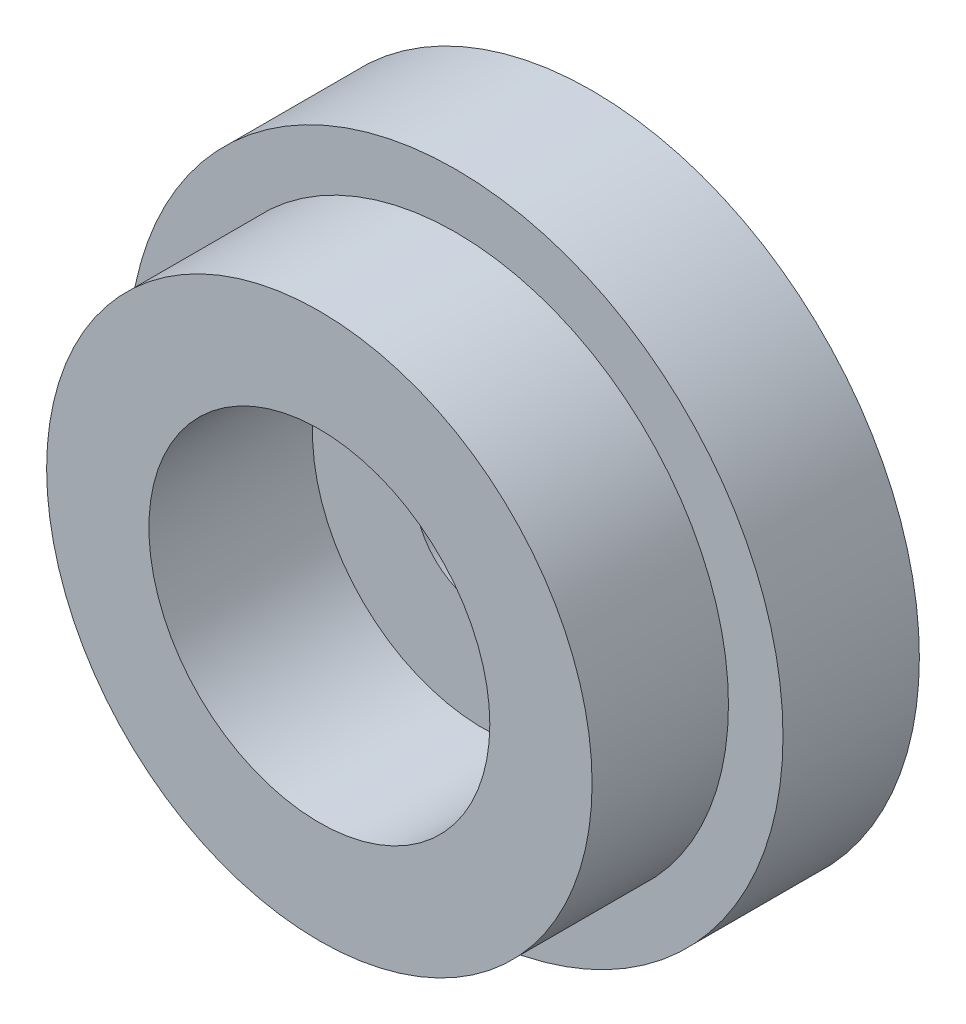
ISO-10303-21;
HEADER;
FILE_DESCRIPTION(('STEP AP214'),'2;1');
FILE_NAME('part.step','',(''),(''),'','','');
FILE_SCHEMA(('AUTOMOTIVE_DESIGN { 1 0 10303 214 1 1 1 1 }'));
ENDSEC;
DATA;
#1=APPLICATION_CONTEXT('core data for automotive mechanical design processes');
#2=APPLICATION_PROTOCOL_DEFINITION('international standard','automotive_design',2000,#1);
#3=PRODUCT_CONTEXT('',#1,'mechanical');
#4=PRODUCT('Part','Part','',(#3));
#5=PRODUCT_RELATED_PRODUCT_CATEGORY('part','',(#4));
#6=PRODUCT_DEFINITION_FORMATION('','',#4);
#7=PRODUCT_DEFINITION_CONTEXT('part definition',#1,'design');
#8=PRODUCT_DEFINITION('design','',#6,#7);
#9=PRODUCT_DEFINITION_SHAPE('','',#8);
#10=(LENGTH_UNIT() NAMED_UNIT(*) SI_UNIT(.MILLI.,.METRE.));
#11=(NAMED_UNIT(*) PLANE_ANGLE_UNIT() SI_UNIT($,.RADIAN.));
#12=(NAMED_UNIT(*) SI_UNIT($,.STERADIAN.) SOLID_ANGLE_UNIT());
#13=UNCERTAINTY_MEASURE_WITH_UNIT(LENGTH_MEASURE(1.E-05),#10,'distance_accuracy_value','');
#14=(GEOMETRIC_REPRESENTATION_CONTEXT(3) GLOBAL_UNCERTAINTY_ASSIGNED_CONTEXT((#13)) GLOBAL_UNIT_ASSIGNED_CONTEXT((#10,
#11,#12)) REPRESENTATION_CONTEXT('',''));
#15=CARTESIAN_POINT('',(0.,0.,0.));
#16=DIRECTION('',(0.,0.,1.));
#17=DIRECTION('',(1.,0.,0.));
#18=AXIS2_PLACEMENT_3D('',#15,#16,#17);
#19=CARTESIAN_POINT('',(0.,0.,-10.));
#20=DIRECTION('',(0.,0.,1.));
#21=DIRECTION('',(1.,0.,0.));
#22=AXIS2_PLACEMENT_3D('',#19,#20,#21);
#23=CYLINDRICAL_SURFACE('',#22,5.);
#24=CARTESIAN_POINT('',(0.,0.,-8.00000000000001));
#25=DIRECTION('',(0.,0.,1.));
#26=DIRECTION('',(1.,0.,0.));
#27=AXIS2_PLACEMENT_3D('',#24,#25,#26);
#28=CIRCLE('',#27,5.);
#29=CARTESIAN_POINT('',(5.,0.,-8.00000000000001));
#30=VERTEX_POINT('',#29);
#31=EDGE_CURVE('E112',#30,#30,#28,.T.);
#32=ORIENTED_EDGE('',*,*,#31,.F.);
#33=EDGE_LOOP('',(#32));
#34=FACE_BOUND('',#33,.T.);
#35=CARTESIAN_POINT('',(0.,0.,-2.));
#36=DIRECTION('',(0.,0.,1.));
#37=DIRECTION('',(1.,0.,0.));
#38=AXIS2_PLACEMENT_3D('',#35,#36,#37);
#39=CIRCLE('',#38,5.);
#40=CARTESIAN_POINT('',(5.,0.,-2.));
#41=VERTEX_POINT('',#40);
#42=EDGE_CURVE('E37',#41,#41,#39,.F.);
#43=ORIENTED_EDGE('',*,*,#42,.F.);
#44=EDGE_LOOP('',(#43));
#45=FACE_BOUND('',#44,.T.);
#46=ADVANCED_FACE('F33',(#34,#45),#23,.F.);
#47=CARTESIAN_POINT('',(0.,0.,0.));
#48=DIRECTION('',(0.,0.,-1.));
#49=DIRECTION('',(-1.,0.,0.));
#50=AXIS2_PLACEMENT_3D('',#47,#48,#49);
#51=PLANE('',#50);
#52=CARTESIAN_POINT('',(0.,0.,0.));
#53=DIRECTION('',(0.,0.,1.));
#54=DIRECTION('',(1.,0.,0.));
#55=AXIS2_PLACEMENT_3D('',#52,#53,#54);
#56=CIRCLE('',#55,20.);
#57=CARTESIAN_POINT('',(20.,0.,0.));
#58=VERTEX_POINT('',#57);
#59=EDGE_CURVE('E10',#58,#58,#56,.T.);
#60=ORIENTED_EDGE('',*,*,#59,.F.);
#61=EDGE_LOOP('',(#60));
#62=FACE_BOUND('',#61,.T.);
#63=CARTESIAN_POINT('',(0.,0.,0.));
#64=DIRECTION('',(0.,0.,1.));
#65=DIRECTION('',(1.,0.,0.));
#66=AXIS2_PLACEMENT_3D('',#63,#64,#65);
#67=CIRCLE('',#66,24.);
#68=CARTESIAN_POINT('',(24.,0.,0.));
#69=VERTEX_POINT('',#68);
#70=EDGE_CURVE('E41',#69,#69,#67,.T.);
#71=ORIENTED_EDGE('',*,*,#70,.T.);
#72=EDGE_LOOP('',(#71));
#73=FACE_BOUND('',#72,.T.);
#74=ADVANCED_FACE('F35',(#62,#73),#51,.F.);
#75=CARTESIAN_POINT('',(0.,0.,0.));
#76=DIRECTION('',(0.,0.,1.));
#77=DIRECTION('',(1.,0.,0.));
#78=AXIS2_PLACEMENT_3D('',#75,#76,#77);
#79=CYLINDRICAL_SURFACE('',#78,24.);
#80=ORIENTED_EDGE('',*,*,#70,.F.);
#81=EDGE_LOOP('',(#80));
#82=FACE_BOUND('',#81,.T.);
#83=CARTESIAN_POINT('',(0.,0.,-10.));
#84=DIRECTION('',(0.,0.,1.));
#85=DIRECTION('',(1.,0.,0.));
#86=AXIS2_PLACEMENT_3D('',#83,#84,#85);
#87=CIRCLE('',#86,24.);
#88=CARTESIAN_POINT('',(24.,0.,-10.));
#89=VERTEX_POINT('',#88);
#90=EDGE_CURVE('E46',#89,#89,#87,.T.);
#91=ORIENTED_EDGE('',*,*,#90,.T.);
#92=EDGE_LOOP('',(#91));
#93=FACE_BOUND('',#92,.T.);
#94=ADVANCED_FACE('F60',(#82,#93),#79,.T.);
#95=CARTESIAN_POINT('',(0.,24.,-10.));
#96=DIRECTION('',(0.,0.,1.));
#97=DIRECTION('',(1.,0.,0.));
#98=AXIS2_PLACEMENT_3D('',#95,#96,#97);
#99=PLANE('',#98);
#100=ORIENTED_EDGE('',*,*,#90,.F.);
#101=EDGE_LOOP('',(#100));
#102=FACE_BOUND('',#101,.T.);
#103=CARTESIAN_POINT('',(0.,0.,-10.));
#104=DIRECTION('',(0.,0.,1.));
#105=DIRECTION('',(1.,0.,0.));
#106=AXIS2_PLACEMENT_3D('',#103,#104,#105);
#107=CIRCLE('',#106,10.45);
#108=CARTESIAN_POINT('',(10.45,0.,-10.));
#109=VERTEX_POINT('',#108);
#110=EDGE_CURVE('E54',#109,#109,#107,.T.);
#111=ORIENTED_EDGE('',*,*,#110,.T.);
#112=EDGE_LOOP('',(#111));
#113=FACE_BOUND('',#112,.T.);
#114=ADVANCED_FACE('F62',(#102,#113),#99,.F.);
#115=CARTESIAN_POINT('',(0.,0.,0.));
#116=DIRECTION('',(0.,0.,1.));
#117=DIRECTION('',(1.,0.,0.));
#118=AXIS2_PLACEMENT_3D('',#115,#116,#117);
#119=CYLINDRICAL_SURFACE('',#118,10.45);
#120=ORIENTED_EDGE('',*,*,#110,.F.);
#121=EDGE_LOOP('',(#120));
#122=FACE_BOUND('',#121,.T.);
#123=CARTESIAN_POINT('',(0.,0.,-8.00000000000001));
#124=DIRECTION('',(0.,0.,1.));
#125=DIRECTION('',(1.,0.,0.));
#126=AXIS2_PLACEMENT_3D('',#123,#124,#125);
#127=CIRCLE('',#126,10.45);
#128=CARTESIAN_POINT('',(10.45,0.,-8.00000000000001));
#129=VERTEX_POINT('',#128);
#130=EDGE_CURVE('E51',#129,#129,#127,.T.);
#131=ORIENTED_EDGE('',*,*,#130,.T.);
#132=EDGE_LOOP('',(#131));
#133=FACE_BOUND('',#132,.T.);
#134=ADVANCED_FACE('F65',(#122,#133),#119,.F.);
#135=CARTESIAN_POINT('',(0.,10.45,-8.00000000000001));
#136=DIRECTION('',(0.,0.,1.));
#137=DIRECTION('',(1.,0.,0.));
#138=AXIS2_PLACEMENT_3D('',#135,#136,#137);
#139=PLANE('',#138);
#140=ORIENTED_EDGE('',*,*,#31,.T.);
#141=EDGE_LOOP('',(#140));
#142=FACE_BOUND('',#141,.T.);
#143=ORIENTED_EDGE('',*,*,#130,.F.);
#144=EDGE_LOOP('',(#143));
#145=FACE_BOUND('',#144,.T.);
#146=ADVANCED_FACE('F71',(#142,#145),#139,.F.);
#147=CARTESIAN_POINT('',(0.,0.,10.));
#148=DIRECTION('',(0.,0.,-1.));
#149=DIRECTION('',(-1.,0.,0.));
#150=AXIS2_PLACEMENT_3D('',#147,#148,#149);
#151=CYLINDRICAL_SURFACE('',#150,20.);
#152=CARTESIAN_POINT('',(0.,0.,10.));
#153=DIRECTION('',(0.,0.,1.));
#154=DIRECTION('',(1.,0.,0.));
#155=AXIS2_PLACEMENT_3D('',#152,#153,#154);
#156=CIRCLE('',#155,20.);
#157=CARTESIAN_POINT('',(20.,0.,10.));
#158=VERTEX_POINT('',#157);
#159=EDGE_CURVE('E49',#158,#158,#156,.T.);
#160=ORIENTED_EDGE('',*,*,#159,.F.);
#161=EDGE_LOOP('',(#160));
#162=FACE_BOUND('',#161,.T.);
#163=ORIENTED_EDGE('',*,*,#59,.T.);
#164=EDGE_LOOP('',(#163));
#165=FACE_BOUND('',#164,.T.);
#166=ADVANCED_FACE('F76',(#162,#165),#151,.T.);
#167=CARTESIAN_POINT('',(0.,0.,10.));
#168=DIRECTION('',(0.,0.,1.));
#169=DIRECTION('',(1.,0.,0.));
#170=AXIS2_PLACEMENT_3D('',#167,#168,#169);
#171=PLANE('',#170);
#172=CARTESIAN_POINT('',(0.,0.,10.));
#173=DIRECTION('',(0.,0.,1.));
#174=DIRECTION('',(1.,0.,0.));
#175=AXIS2_PLACEMENT_3D('',#172,#173,#174);
#176=CIRCLE('',#175,12.5);
#177=CARTESIAN_POINT('',(12.5,0.,10.));
#178=VERTEX_POINT('',#177);
#179=EDGE_CURVE('E109',#178,#178,#176,.T.);
#180=ORIENTED_EDGE('',*,*,#179,.F.);
#181=EDGE_LOOP('',(#180));
#182=FACE_BOUND('',#181,.T.);
#183=ORIENTED_EDGE('',*,*,#159,.T.);
#184=EDGE_LOOP('',(#183));
#185=FACE_BOUND('',#184,.T.);
#186=ADVANCED_FACE('F82',(#182,#185),#171,.T.);
#187=CARTESIAN_POINT('',(0.,0.,-2.));
#188=DIRECTION('',(0.,0.,1.));
#189=DIRECTION('',(1.,0.,0.));
#190=AXIS2_PLACEMENT_3D('',#187,#188,#189);
#191=PLANE('',#190);
#192=CARTESIAN_POINT('',(0.,0.,-2.));
#193=DIRECTION('',(0.,0.,1.));
#194=DIRECTION('',(1.,0.,0.));
#195=AXIS2_PLACEMENT_3D('',#192,#193,#194);
#196=CIRCLE('',#195,12.5);
#197=CARTESIAN_POINT('',(12.5,0.,-2.));
#198=VERTEX_POINT('',#197);
#199=EDGE_CURVE('E114',#198,#198,#196,.T.);
#200=ORIENTED_EDGE('',*,*,#199,.T.);
#201=EDGE_LOOP('',(#200));
#202=FACE_BOUND('',#201,.T.);
#203=ORIENTED_EDGE('',*,*,#42,.T.);
#204=EDGE_LOOP('',(#203));
#205=FACE_BOUND('',#204,.T.);
#206=ADVANCED_FACE('F100',(#202,#205),#191,.T.);
#207=CARTESIAN_POINT('',(0.,0.,-2.));
#208=DIRECTION('',(0.,0.,1.));
#209=DIRECTION('',(1.,0.,0.));
#210=AXIS2_PLACEMENT_3D('',#207,#208,#209);
#211=CYLINDRICAL_SURFACE('',#210,12.5);
#212=ORIENTED_EDGE('',*,*,#199,.F.);
#213=EDGE_LOOP('',(#212));
#214=FACE_BOUND('',#213,.T.);
#215=ORIENTED_EDGE('',*,*,#179,.T.);
#216=EDGE_LOOP('',(#215));
#217=FACE_BOUND('',#216,.T.);
#218=ADVANCED_FACE('F97',(#214,#217),#211,.F.);
#219=CLOSED_SHELL('',(#46,#74,#94,#114,#134,#146,#166,#186,#206,#218));
#220=MANIFOLD_SOLID_BREP('B2',#219);
#221=ADVANCED_BREP_SHAPE_REPRESENTATION('',(#18,#220),#14);
#222=SHAPE_DEFINITION_REPRESENTATION(#9,#221);
ENDSEC;
END-ISO-10303-21;
